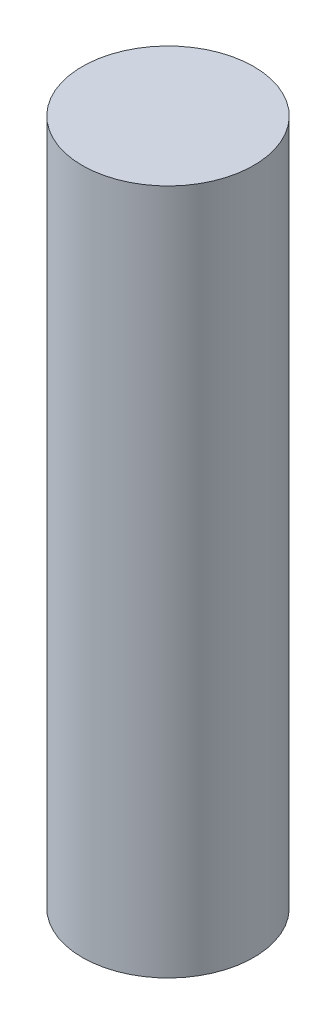
ISO-10303-21;
HEADER;
FILE_DESCRIPTION(('STEP AP214'),'2;1');
FILE_NAME('part.step','',(''),(''),'','','');
FILE_SCHEMA(('AUTOMOTIVE_DESIGN { 1 0 10303 214 1 1 1 1 }'));
ENDSEC;
DATA;
#1=APPLICATION_CONTEXT('core data for automotive mechanical design processes');
#2=APPLICATION_PROTOCOL_DEFINITION('international standard','automotive_design',2000,#1);
#3=PRODUCT_CONTEXT('',#1,'mechanical');
#4=PRODUCT('Part','Part','',(#3));
#5=PRODUCT_RELATED_PRODUCT_CATEGORY('part','',(#4));
#6=PRODUCT_DEFINITION_FORMATION('','',#4);
#7=PRODUCT_DEFINITION_CONTEXT('part definition',#1,'design');
#8=PRODUCT_DEFINITION('design','',#6,#7);
#9=PRODUCT_DEFINITION_SHAPE('','',#8);
#10=(LENGTH_UNIT() NAMED_UNIT(*) SI_UNIT(.MILLI.,.METRE.));
#11=(NAMED_UNIT(*) PLANE_ANGLE_UNIT() SI_UNIT($,.RADIAN.));
#12=(NAMED_UNIT(*) SI_UNIT($,.STERADIAN.) SOLID_ANGLE_UNIT());
#13=UNCERTAINTY_MEASURE_WITH_UNIT(LENGTH_MEASURE(1.E-05),#10,'distance_accuracy_value','');
#14=(GEOMETRIC_REPRESENTATION_CONTEXT(3) GLOBAL_UNCERTAINTY_ASSIGNED_CONTEXT((#13)) GLOBAL_UNIT_ASSIGNED_CONTEXT((#10,
#11,#12)) REPRESENTATION_CONTEXT('',''));
#15=CARTESIAN_POINT('',(0.,0.,0.));
#16=DIRECTION('',(0.,0.,1.));
#17=DIRECTION('',(1.,0.,0.));
#18=AXIS2_PLACEMENT_3D('',#15,#16,#17);
#19=CARTESIAN_POINT('',(0.,2.,0.));
#20=DIRECTION('',(0.,-1.,0.));
#21=DIRECTION('',(0.,0.,-1.));
#22=AXIS2_PLACEMENT_3D('',#19,#20,#21);
#23=CYLINDRICAL_SURFACE('',#22,0.25);
#24=CARTESIAN_POINT('',(0.,2.,0.));
#25=DIRECTION('',(0.,1.,0.));
#26=DIRECTION('',(0.,0.,1.));
#27=AXIS2_PLACEMENT_3D('',#24,#25,#26);
#28=CIRCLE('',#27,0.25);
#29=CARTESIAN_POINT('',(0.,2.,0.25));
#30=VERTEX_POINT('',#29);
#31=EDGE_CURVE('E10',#30,#30,#28,.T.);
#32=ORIENTED_EDGE('',*,*,#31,.F.);
#33=EDGE_LOOP('',(#32));
#34=FACE_BOUND('',#33,.T.);
#35=CARTESIAN_POINT('',(0.,0.,0.));
#36=DIRECTION('',(0.,1.,0.));
#37=DIRECTION('',(0.,0.,1.));
#38=AXIS2_PLACEMENT_3D('',#35,#36,#37);
#39=CIRCLE('',#38,0.25);
#40=CARTESIAN_POINT('',(0.,0.,0.25));
#41=VERTEX_POINT('',#40);
#42=EDGE_CURVE('E33',#41,#41,#39,.T.);
#43=ORIENTED_EDGE('',*,*,#42,.T.);
#44=EDGE_LOOP('',(#43));
#45=FACE_BOUND('',#44,.T.);
#46=ADVANCED_FACE('F30',(#34,#45),#23,.T.);
#47=CARTESIAN_POINT('',(0.,2.,0.));
#48=DIRECTION('',(0.,1.,0.));
#49=DIRECTION('',(0.,0.,1.));
#50=AXIS2_PLACEMENT_3D('',#47,#48,#49);
#51=PLANE('',#50);
#52=ORIENTED_EDGE('',*,*,#31,.T.);
#53=EDGE_LOOP('',(#52));
#54=FACE_BOUND('',#53,.T.);
#55=ADVANCED_FACE('F45',(#54),#51,.T.);
#56=CARTESIAN_POINT('',(0.,0.,0.));
#57=DIRECTION('',(0.,1.,0.));
#58=DIRECTION('',(0.,0.,1.));
#59=AXIS2_PLACEMENT_3D('',#56,#57,#58);
#60=PLANE('',#59);
#61=ORIENTED_EDGE('',*,*,#42,.F.);
#62=EDGE_LOOP('',(#61));
#63=FACE_BOUND('',#62,.T.);
#64=ADVANCED_FACE('F43',(#63),#60,.F.);
#65=CLOSED_SHELL('',(#46,#55,#64));
#66=MANIFOLD_SOLID_BREP('B2',#65);
#67=ADVANCED_BREP_SHAPE_REPRESENTATION('',(#18,#66),#14);
#68=SHAPE_DEFINITION_REPRESENTATION(#9,#67);
ENDSEC;
END-ISO-10303-21;
